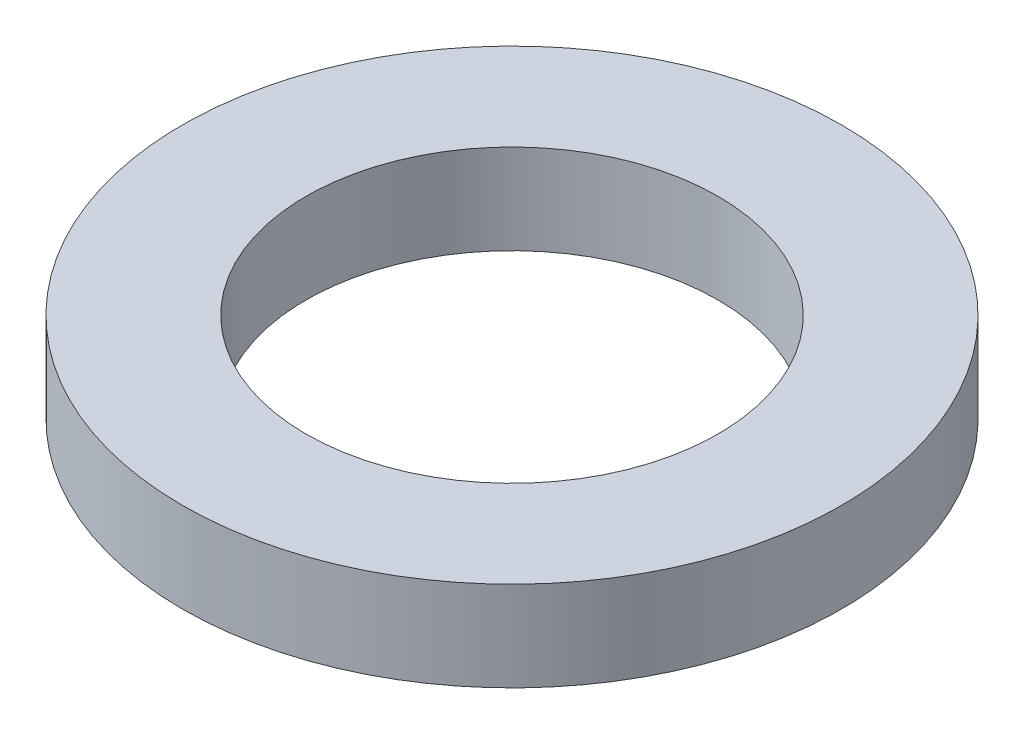
ISO-10303-21;
HEADER;
FILE_DESCRIPTION(('STEP AP214'),'2;1');
FILE_NAME('part.step','',(''),(''),'','','');
FILE_SCHEMA(('AUTOMOTIVE_DESIGN { 1 0 10303 214 1 1 1 1 }'));
ENDSEC;
DATA;
#1=APPLICATION_CONTEXT('core data for automotive mechanical design processes');
#2=APPLICATION_PROTOCOL_DEFINITION('international standard','automotive_design',2000,#1);
#3=PRODUCT_CONTEXT('',#1,'mechanical');
#4=PRODUCT('Part','Part','',(#3));
#5=PRODUCT_RELATED_PRODUCT_CATEGORY('part','',(#4));
#6=PRODUCT_DEFINITION_FORMATION('','',#4);
#7=PRODUCT_DEFINITION_CONTEXT('part definition',#1,'design');
#8=PRODUCT_DEFINITION('design','',#6,#7);
#9=PRODUCT_DEFINITION_SHAPE('','',#8);
#10=(LENGTH_UNIT() NAMED_UNIT(*) SI_UNIT(.MILLI.,.METRE.));
#11=(NAMED_UNIT(*) PLANE_ANGLE_UNIT() SI_UNIT($,.RADIAN.));
#12=(NAMED_UNIT(*) SI_UNIT($,.STERADIAN.) SOLID_ANGLE_UNIT());
#13=UNCERTAINTY_MEASURE_WITH_UNIT(LENGTH_MEASURE(1.E-05),#10,'distance_accuracy_value','');
#14=(GEOMETRIC_REPRESENTATION_CONTEXT(3) GLOBAL_UNCERTAINTY_ASSIGNED_CONTEXT((#13)) GLOBAL_UNIT_ASSIGNED_CONTEXT((#10,
#11,#12)) REPRESENTATION_CONTEXT('',''));
#15=CARTESIAN_POINT('',(0.,0.,0.));
#16=DIRECTION('',(0.,0.,1.));
#17=DIRECTION('',(1.,0.,0.));
#18=AXIS2_PLACEMENT_3D('',#15,#16,#17);
#19=CARTESIAN_POINT('',(0.,1.09,0.));
#20=DIRECTION('',(0.,1.,0.));
#21=DIRECTION('',(0.,0.,1.));
#22=AXIS2_PLACEMENT_3D('',#19,#20,#21);
#23=PLANE('',#22);
#24=CARTESIAN_POINT('',(0.,1.09,0.));
#25=DIRECTION('',(0.,1.,0.));
#26=DIRECTION('',(0.,0.,1.));
#27=AXIS2_PLACEMENT_3D('',#24,#25,#26);
#28=CIRCLE('',#27,4.);
#29=CARTESIAN_POINT('',(0.,1.09,4.));
#30=VERTEX_POINT('',#29);
#31=EDGE_CURVE('E10',#30,#30,#28,.T.);
#32=ORIENTED_EDGE('',*,*,#31,.T.);
#33=EDGE_LOOP('',(#32));
#34=FACE_BOUND('',#33,.T.);
#35=CARTESIAN_POINT('',(0.,1.09,0.));
#36=DIRECTION('',(0.,1.,0.));
#37=DIRECTION('',(0.,0.,1.));
#38=AXIS2_PLACEMENT_3D('',#35,#36,#37);
#39=CIRCLE('',#38,2.5);
#40=CARTESIAN_POINT('',(0.,1.09,2.5));
#41=VERTEX_POINT('',#40);
#42=EDGE_CURVE('E45',#41,#41,#39,.T.);
#43=ORIENTED_EDGE('',*,*,#42,.F.);
#44=EDGE_LOOP('',(#43));
#45=FACE_BOUND('',#44,.T.);
#46=ADVANCED_FACE('F34',(#34,#45),#23,.T.);
#47=CARTESIAN_POINT('',(0.,0.,0.));
#48=DIRECTION('',(0.,1.,0.));
#49=DIRECTION('',(0.,0.,1.));
#50=AXIS2_PLACEMENT_3D('',#47,#48,#49);
#51=PLANE('',#50);
#52=CARTESIAN_POINT('',(0.,0.,0.));
#53=DIRECTION('',(0.,1.,0.));
#54=DIRECTION('',(0.,0.,1.));
#55=AXIS2_PLACEMENT_3D('',#52,#53,#54);
#56=CIRCLE('',#55,4.);
#57=CARTESIAN_POINT('',(0.,0.,4.));
#58=VERTEX_POINT('',#57);
#59=EDGE_CURVE('E38',#58,#58,#56,.T.);
#60=ORIENTED_EDGE('',*,*,#59,.F.);
#61=EDGE_LOOP('',(#60));
#62=FACE_BOUND('',#61,.T.);
#63=CARTESIAN_POINT('',(0.,0.,0.));
#64=DIRECTION('',(0.,1.,0.));
#65=DIRECTION('',(0.,0.,1.));
#66=AXIS2_PLACEMENT_3D('',#63,#64,#65);
#67=CIRCLE('',#66,2.5);
#68=CARTESIAN_POINT('',(0.,0.,2.5));
#69=VERTEX_POINT('',#68);
#70=EDGE_CURVE('E47',#69,#69,#67,.T.);
#71=ORIENTED_EDGE('',*,*,#70,.T.);
#72=EDGE_LOOP('',(#71));
#73=FACE_BOUND('',#72,.T.);
#74=ADVANCED_FACE('F57',(#62,#73),#51,.F.);
#75=CARTESIAN_POINT('',(0.,1.09,0.));
#76=DIRECTION('',(0.,-1.,0.));
#77=DIRECTION('',(0.,0.,-1.));
#78=AXIS2_PLACEMENT_3D('',#75,#76,#77);
#79=CYLINDRICAL_SURFACE('',#78,4.);
#80=ORIENTED_EDGE('',*,*,#31,.F.);
#81=EDGE_LOOP('',(#80));
#82=FACE_BOUND('',#81,.T.);
#83=ORIENTED_EDGE('',*,*,#59,.T.);
#84=EDGE_LOOP('',(#83));
#85=FACE_BOUND('',#84,.T.);
#86=ADVANCED_FACE('F36',(#82,#85),#79,.T.);
#87=CARTESIAN_POINT('',(0.,1.09,0.));
#88=DIRECTION('',(0.,-1.,0.));
#89=DIRECTION('',(0.,0.,-1.));
#90=AXIS2_PLACEMENT_3D('',#87,#88,#89);
#91=CYLINDRICAL_SURFACE('',#90,2.5);
#92=ORIENTED_EDGE('',*,*,#42,.T.);
#93=EDGE_LOOP('',(#92));
#94=FACE_BOUND('',#93,.T.);
#95=ORIENTED_EDGE('',*,*,#70,.F.);
#96=EDGE_LOOP('',(#95));
#97=FACE_BOUND('',#96,.T.);
#98=ADVANCED_FACE('F53',(#94,#97),#91,.F.);
#99=CLOSED_SHELL('',(#46,#74,#86,#98));
#100=MANIFOLD_SOLID_BREP('B2',#99);
#101=ADVANCED_BREP_SHAPE_REPRESENTATION('',(#18,#100),#14);
#102=SHAPE_DEFINITION_REPRESENTATION(#9,#101);
ENDSEC;
END-ISO-10303-21;
